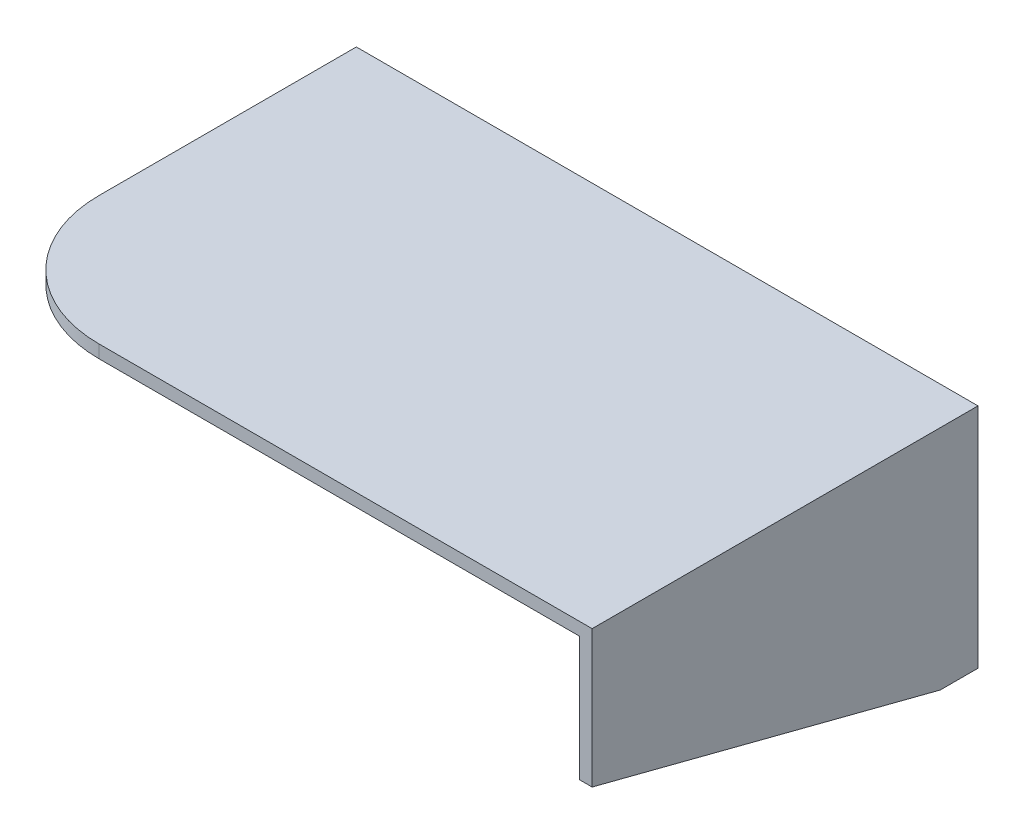
ISO-10303-21;
HEADER;
FILE_DESCRIPTION(('STEP AP214'),'2;1');
FILE_NAME('part.step','',(''),(''),'','','');
FILE_SCHEMA(('AUTOMOTIVE_DESIGN { 1 0 10303 214 1 1 1 1 }'));
ENDSEC;
DATA;
#1=APPLICATION_CONTEXT('core data for automotive mechanical design processes');
#2=APPLICATION_PROTOCOL_DEFINITION('international standard','automotive_design',2000,#1);
#3=PRODUCT_CONTEXT('',#1,'mechanical');
#4=PRODUCT('Part','Part','',(#3));
#5=PRODUCT_RELATED_PRODUCT_CATEGORY('part','',(#4));
#6=PRODUCT_DEFINITION_FORMATION('','',#4);
#7=PRODUCT_DEFINITION_CONTEXT('part definition',#1,'design');
#8=PRODUCT_DEFINITION('design','',#6,#7);
#9=PRODUCT_DEFINITION_SHAPE('','',#8);
#10=(LENGTH_UNIT() NAMED_UNIT(*) SI_UNIT(.MILLI.,.METRE.));
#11=(NAMED_UNIT(*) PLANE_ANGLE_UNIT() SI_UNIT($,.RADIAN.));
#12=(NAMED_UNIT(*) SI_UNIT($,.STERADIAN.) SOLID_ANGLE_UNIT());
#13=UNCERTAINTY_MEASURE_WITH_UNIT(LENGTH_MEASURE(1.E-05),#10,'distance_accuracy_value','');
#14=(GEOMETRIC_REPRESENTATION_CONTEXT(3) GLOBAL_UNCERTAINTY_ASSIGNED_CONTEXT((#13)) GLOBAL_UNIT_ASSIGNED_CONTEXT((#10,
#11,#12)) REPRESENTATION_CONTEXT('',''));
#15=CARTESIAN_POINT('',(0.,0.,0.));
#16=DIRECTION('',(0.,0.,1.));
#17=DIRECTION('',(1.,0.,0.));
#18=AXIS2_PLACEMENT_3D('',#15,#16,#17);
#19=CARTESIAN_POINT('',(-6.15241498392368,0.,6.));
#20=DIRECTION('',(-1.,0.,0.));
#21=DIRECTION('',(0.,-1.,0.));
#22=AXIS2_PLACEMENT_3D('',#19,#20,#21);
#23=PLANE('',#22);
#24=DIRECTION('',(0.,0.,-1.));
#25=VECTOR('',#24,1.);
#26=CARTESIAN_POINT('',(-6.15241498392364,1.,90.0000000000001));
#27=LINE('',#26,#25);
#28=CARTESIAN_POINT('',(-6.15241498392364,1.,6.00000000000001));
#29=VERTEX_POINT('',#28);
#30=CARTESIAN_POINT('',(-6.15241498392364,1.,0.));
#31=VERTEX_POINT('',#30);
#32=EDGE_CURVE('E541',#29,#31,#27,.T.);
#33=ORIENTED_EDGE('',*,*,#32,.F.);
#34=DIRECTION('',(0.,1.,0.));
#35=VECTOR('',#34,1.);
#36=CARTESIAN_POINT('',(-6.15241498392368,0.,6.));
#37=LINE('',#36,#35);
#38=CARTESIAN_POINT('',(-6.15241498392372,4.04799999999993,6.));
#39=VERTEX_POINT('',#38);
#40=EDGE_CURVE('E281',#29,#39,#37,.T.);
#41=ORIENTED_EDGE('',*,*,#40,.T.);
#42=DIRECTION('',(0.,0.,-1.));
#43=VECTOR('',#42,1.);
#44=CARTESIAN_POINT('',(-6.15241498392372,4.04799999999993,6.));
#45=LINE('',#44,#43);
#46=CARTESIAN_POINT('',(-6.15241498392372,4.04799999999993,0.));
#47=VERTEX_POINT('',#46);
#48=EDGE_CURVE('E360',#39,#47,#45,.T.);
#49=ORIENTED_EDGE('',*,*,#48,.T.);
#50=DIRECTION('',(0.,1.,0.));
#51=VECTOR('',#50,1.);
#52=CARTESIAN_POINT('',(-6.15241498392368,0.,0.));
#53=LINE('',#52,#51);
#54=EDGE_CURVE('E323',#31,#47,#53,.T.);
#55=ORIENTED_EDGE('',*,*,#54,.F.);
#56=EDGE_LOOP('',(#33,#41,#49,#55));
#57=FACE_BOUND('',#56,.T.);
#58=ADVANCED_FACE('F45',(#57),#23,.T.);
#59=CARTESIAN_POINT('',(0.,4.05,6.));
#60=DIRECTION('',(0.,1.,0.));
#61=DIRECTION('',(0.,0.,1.));
#62=AXIS2_PLACEMENT_3D('',#59,#60,#61);
#63=PLANE('',#62);
#64=DIRECTION('',(1.,0.,0.));
#65=VECTOR('',#64,1.);
#66=CARTESIAN_POINT('',(0.,4.05,0.));
#67=LINE('',#66,#65);
#68=CARTESIAN_POINT('',(0.,4.05,0.));
#69=VERTEX_POINT('',#68);
#70=CARTESIAN_POINT('',(2.49999999999992,4.05,0.));
#71=VERTEX_POINT('',#70);
#72=EDGE_CURVE('E262',#69,#71,#67,.T.);
#73=ORIENTED_EDGE('',*,*,#72,.F.);
#74=DIRECTION('',(0.,0.,-1.));
#75=VECTOR('',#74,1.);
#76=CARTESIAN_POINT('',(0.,4.05,6.));
#77=LINE('',#76,#75);
#78=CARTESIAN_POINT('',(0.,4.05,6.));
#79=VERTEX_POINT('',#78);
#80=EDGE_CURVE('E370',#79,#69,#77,.T.);
#81=ORIENTED_EDGE('',*,*,#80,.F.);
#82=DIRECTION('',(1.,0.,0.));
#83=VECTOR('',#82,1.);
#84=CARTESIAN_POINT('',(0.,4.05,6.));
#85=LINE('',#84,#83);
#86=CARTESIAN_POINT('',(2.49999999999992,4.05,6.));
#87=VERTEX_POINT('',#86);
#88=EDGE_CURVE('E263',#79,#87,#85,.T.);
#89=ORIENTED_EDGE('',*,*,#88,.T.);
#90=DIRECTION('',(0.,0.,-1.));
#91=VECTOR('',#90,1.);
#92=CARTESIAN_POINT('',(2.49999999999992,4.05,6.));
#93=LINE('',#92,#91);
#94=EDGE_CURVE('E306',#87,#71,#93,.T.);
#95=ORIENTED_EDGE('',*,*,#94,.T.);
#96=EDGE_LOOP('',(#73,#81,#89,#95));
#97=FACE_BOUND('',#96,.T.);
#98=ADVANCED_FACE('F584',(#97),#63,.T.);
#99=CARTESIAN_POINT('',(0.,0.,6.));
#100=DIRECTION('',(1.,0.,0.));
#101=DIRECTION('',(0.,1.,0.));
#102=AXIS2_PLACEMENT_3D('',#99,#100,#101);
#103=PLANE('',#102);
#104=DIRECTION('',(0.,-1.,0.));
#105=VECTOR('',#104,1.);
#106=CARTESIAN_POINT('',(0.,0.,0.));
#107=LINE('',#106,#105);
#108=CARTESIAN_POINT('',(0.,7.95,0.));
#109=VERTEX_POINT('',#108);
#110=EDGE_CURVE('E310',#109,#69,#107,.T.);
#111=ORIENTED_EDGE('',*,*,#110,.F.);
#112=DIRECTION('',(0.,0.,-1.));
#113=VECTOR('',#112,1.);
#114=CARTESIAN_POINT('',(0.,7.95,6.));
#115=LINE('',#114,#113);
#116=CARTESIAN_POINT('',(0.,7.95,6.));
#117=VERTEX_POINT('',#116);
#118=EDGE_CURVE('E367',#117,#109,#115,.T.);
#119=ORIENTED_EDGE('',*,*,#118,.F.);
#120=DIRECTION('',(0.,-1.,0.));
#121=VECTOR('',#120,1.);
#122=CARTESIAN_POINT('',(0.,0.,6.));
#123=LINE('',#122,#121);
#124=EDGE_CURVE('E267',#117,#79,#123,.T.);
#125=ORIENTED_EDGE('',*,*,#124,.T.);
#126=ORIENTED_EDGE('',*,*,#80,.T.);
#127=EDGE_LOOP('',(#111,#119,#125,#126));
#128=FACE_BOUND('',#127,.T.);
#129=ADVANCED_FACE('F582',(#128),#103,.T.);
#130=CARTESIAN_POINT('',(0.,7.95,6.));
#131=DIRECTION('',(0.,1.,0.));
#132=DIRECTION('',(-1.,0.,0.));
#133=AXIS2_PLACEMENT_3D('',#130,#131,#132);
#134=PLANE('',#133);
#135=DIRECTION('',(1.,0.,0.));
#136=VECTOR('',#135,1.);
#137=CARTESIAN_POINT('',(0.,7.95,0.));
#138=LINE('',#137,#136);
#139=CARTESIAN_POINT('',(-2.04000000000008,7.94999999999998,0.));
#140=VERTEX_POINT('',#139);
#141=EDGE_CURVE('E314',#140,#109,#138,.T.);
#142=ORIENTED_EDGE('',*,*,#141,.F.);
#143=DIRECTION('',(0.,0.,-1.));
#144=VECTOR('',#143,1.);
#145=CARTESIAN_POINT('',(-2.04000000000008,7.94999999999998,6.));
#146=LINE('',#145,#144);
#147=CARTESIAN_POINT('',(-2.04000000000008,7.94999999999998,6.));
#148=VERTEX_POINT('',#147);
#149=EDGE_CURVE('E364',#148,#140,#146,.T.);
#150=ORIENTED_EDGE('',*,*,#149,.F.);
#151=DIRECTION('',(1.,0.,0.));
#152=VECTOR('',#151,1.);
#153=CARTESIAN_POINT('',(0.,7.95,6.));
#154=LINE('',#153,#152);
#155=EDGE_CURVE('E272',#148,#117,#154,.T.);
#156=ORIENTED_EDGE('',*,*,#155,.T.);
#157=ORIENTED_EDGE('',*,*,#118,.T.);
#158=EDGE_LOOP('',(#142,#150,#156,#157));
#159=FACE_BOUND('',#158,.T.);
#160=ADVANCED_FACE('F578',(#159),#134,.T.);
#161=CARTESIAN_POINT('',(-4.93600140143802,5.20217481392659,6.));
#162=DIRECTION('',(-0.688304815664146,0.725421588273706,0.));
#163=DIRECTION('',(-0.725421588273706,-0.688304815664146,0.));
#164=AXIS2_PLACEMENT_3D('',#161,#162,#163);
#165=PLANE('',#164);
#166=DIRECTION('',(0.725421588273706,0.688304815664146,0.));
#167=VECTOR('',#166,1.);
#168=CARTESIAN_POINT('',(-4.93600140143802,5.20217481392659,0.));
#169=LINE('',#168,#167);
#170=EDGE_CURVE('E319',#47,#140,#169,.T.);
#171=ORIENTED_EDGE('',*,*,#170,.F.);
#172=ORIENTED_EDGE('',*,*,#48,.F.);
#173=DIRECTION('',(0.725421588273706,0.688304815664146,0.));
#174=VECTOR('',#173,1.);
#175=CARTESIAN_POINT('',(-4.93600140143802,5.20217481392659,6.));
#176=LINE('',#175,#174);
#177=EDGE_CURVE('E277',#39,#148,#176,.T.);
#178=ORIENTED_EDGE('',*,*,#177,.T.);
#179=ORIENTED_EDGE('',*,*,#149,.T.);
#180=EDGE_LOOP('',(#171,#172,#178,#179));
#181=FACE_BOUND('',#180,.T.);
#182=ADVANCED_FACE('F575',(#181),#165,.T.);
#183=DIRECTION('',(0.,0.,-1.));
#184=VECTOR('',#183,1.);
#185=CARTESIAN_POINT('',(-6.15241498392364,-1.,90.0000000000001));
#186=LINE('',#185,#184);
#187=CARTESIAN_POINT('',(-6.15241498392364,-1.,6.00000000000001));
#188=VERTEX_POINT('',#187);
#189=CARTESIAN_POINT('',(-6.15241498392364,-1.,0.));
#190=VERTEX_POINT('',#189);
#191=EDGE_CURVE('E544',#188,#190,#186,.T.);
#192=ORIENTED_EDGE('',*,*,#191,.T.);
#193=CARTESIAN_POINT('',(-6.15241498392364,-4.04800000000007,0.));
#194=VERTEX_POINT('',#193);
#195=EDGE_CURVE('E324',#194,#190,#53,.T.);
#196=ORIENTED_EDGE('',*,*,#195,.F.);
#197=DIRECTION('',(0.,0.,-1.));
#198=VECTOR('',#197,1.);
#199=CARTESIAN_POINT('',(-6.15241498392364,-4.04800000000007,6.));
#200=LINE('',#199,#198);
#201=CARTESIAN_POINT('',(-6.15241498392364,-4.04800000000007,6.));
#202=VERTEX_POINT('',#201);
#203=EDGE_CURVE('E357',#202,#194,#200,.T.);
#204=ORIENTED_EDGE('',*,*,#203,.F.);
#205=EDGE_CURVE('E282',#202,#188,#37,.T.);
#206=ORIENTED_EDGE('',*,*,#205,.T.);
#207=EDGE_LOOP('',(#192,#196,#204,#206));
#208=FACE_BOUND('',#207,.T.);
#209=ADVANCED_FACE('F594',(#208),#23,.T.);
#210=CARTESIAN_POINT('',(-4.93600140143791,-5.2021748139267,6.));
#211=DIRECTION('',(-0.68830481566413,-0.725421588273721,0.));
#212=DIRECTION('',(0.725421588273721,-0.68830481566413,0.));
#213=AXIS2_PLACEMENT_3D('',#210,#211,#212);
#214=PLANE('',#213);
#215=DIRECTION('',(-0.725421588273721,0.68830481566413,0.));
#216=VECTOR('',#215,1.);
#217=CARTESIAN_POINT('',(-4.93600140143791,-5.2021748139267,0.));
#218=LINE('',#217,#216);
#219=CARTESIAN_POINT('',(-2.03999999999991,-7.95000000000002,0.));
#220=VERTEX_POINT('',#219);
#221=EDGE_CURVE('E328',#220,#194,#218,.T.);
#222=ORIENTED_EDGE('',*,*,#221,.F.);
#223=DIRECTION('',(0.,0.,-1.));
#224=VECTOR('',#223,1.);
#225=CARTESIAN_POINT('',(-2.03999999999991,-7.95000000000002,6.));
#226=LINE('',#225,#224);
#227=CARTESIAN_POINT('',(-2.03999999999991,-7.95000000000002,6.));
#228=VERTEX_POINT('',#227);
#229=EDGE_CURVE('E354',#228,#220,#226,.T.);
#230=ORIENTED_EDGE('',*,*,#229,.F.);
#231=DIRECTION('',(-0.725421588273721,0.68830481566413,0.));
#232=VECTOR('',#231,1.);
#233=CARTESIAN_POINT('',(-4.93600140143791,-5.2021748139267,6.));
#234=LINE('',#233,#232);
#235=EDGE_CURVE('E286',#228,#202,#234,.T.);
#236=ORIENTED_EDGE('',*,*,#235,.T.);
#237=ORIENTED_EDGE('',*,*,#203,.T.);
#238=EDGE_LOOP('',(#222,#230,#236,#237));
#239=FACE_BOUND('',#238,.T.);
#240=ADVANCED_FACE('F647',(#239),#214,.T.);
#241=CARTESIAN_POINT('',(0.,-7.95,6.));
#242=DIRECTION('',(0.,-1.,0.));
#243=DIRECTION('',(1.,0.,0.));
#244=AXIS2_PLACEMENT_3D('',#241,#242,#243);
#245=PLANE('',#244);
#246=DIRECTION('',(-1.,0.,0.));
#247=VECTOR('',#246,1.);
#248=CARTESIAN_POINT('',(0.,-7.95,0.));
#249=LINE('',#248,#247);
#250=CARTESIAN_POINT('',(0.,-7.95,0.));
#251=VERTEX_POINT('',#250);
#252=EDGE_CURVE('E332',#251,#220,#249,.T.);
#253=ORIENTED_EDGE('',*,*,#252,.F.);
#254=DIRECTION('',(0.,0.,-1.));
#255=VECTOR('',#254,1.);
#256=CARTESIAN_POINT('',(0.,-7.95,6.));
#257=LINE('',#256,#255);
#258=CARTESIAN_POINT('',(0.,-7.95,6.));
#259=VERTEX_POINT('',#258);
#260=EDGE_CURVE('E351',#259,#251,#257,.T.);
#261=ORIENTED_EDGE('',*,*,#260,.F.);
#262=DIRECTION('',(-1.,0.,0.));
#263=VECTOR('',#262,1.);
#264=CARTESIAN_POINT('',(0.,-7.95,6.));
#265=LINE('',#264,#263);
#266=EDGE_CURVE('E290',#259,#228,#265,.T.);
#267=ORIENTED_EDGE('',*,*,#266,.T.);
#268=ORIENTED_EDGE('',*,*,#229,.T.);
#269=EDGE_LOOP('',(#253,#261,#267,#268));
#270=FACE_BOUND('',#269,.T.);
#271=ADVANCED_FACE('F643',(#270),#245,.T.);
#272=CARTESIAN_POINT('',(0.,-4.05,0.));
#273=VERTEX_POINT('',#272);
#274=EDGE_CURVE('E315',#273,#251,#107,.T.);
#275=ORIENTED_EDGE('',*,*,#274,.F.);
#276=DIRECTION('',(0.,0.,-1.));
#277=VECTOR('',#276,1.);
#278=CARTESIAN_POINT('',(0.,-4.05,6.));
#279=LINE('',#278,#277);
#280=CARTESIAN_POINT('',(0.,-4.05,6.));
#281=VERTEX_POINT('',#280);
#282=EDGE_CURVE('E348',#281,#273,#279,.T.);
#283=ORIENTED_EDGE('',*,*,#282,.F.);
#284=EDGE_CURVE('E273',#281,#259,#123,.T.);
#285=ORIENTED_EDGE('',*,*,#284,.T.);
#286=ORIENTED_EDGE('',*,*,#260,.T.);
#287=EDGE_LOOP('',(#275,#283,#285,#286));
#288=FACE_BOUND('',#287,.T.);
#289=ADVANCED_FACE('F592',(#288),#103,.T.);
#290=CARTESIAN_POINT('',(0.,-4.05,6.));
#291=DIRECTION('',(0.,1.,0.));
#292=DIRECTION('',(-1.,0.,0.));
#293=AXIS2_PLACEMENT_3D('',#290,#291,#292);
#294=PLANE('',#293);
#295=CARTESIAN_POINT('',(13.4999999999999,-4.05,6.));
#296=DIRECTION('',(0.,1.,0.));
#297=DIRECTION('',(-1.,0.,0.));
#298=AXIS2_PLACEMENT_3D('',#295,#296,#297);
#299=CIRCLE('',#298,3.);
#300=CARTESIAN_POINT('',(13.4999999999999,-4.05,3.));
#301=VERTEX_POINT('',#300);
#302=CARTESIAN_POINT('',(10.9019237886466,-4.05,4.5));
#303=VERTEX_POINT('',#302);
#304=EDGE_CURVE('E383',#301,#303,#299,.T.);
#305=ORIENTED_EDGE('',*,*,#304,.T.);
#306=CARTESIAN_POINT('',(8.30384757729329,-4.05,3.));
#307=DIRECTION('',(0.,1.,0.));
#308=DIRECTION('',(-1.,0.,0.));
#309=AXIS2_PLACEMENT_3D('',#306,#307,#308);
#310=CIRCLE('',#309,3.);
#311=CARTESIAN_POINT('',(8.3038475772933,-4.05,6.));
#312=VERTEX_POINT('',#311);
#313=EDGE_CURVE('E391',#303,#312,#310,.F.);
#314=ORIENTED_EDGE('',*,*,#313,.T.);
#315=DIRECTION('',(1.,0.,0.));
#316=VECTOR('',#315,1.);
#317=CARTESIAN_POINT('',(0.,-4.05,6.));
#318=LINE('',#317,#316);
#319=EDGE_CURVE('E294',#281,#312,#318,.T.);
#320=ORIENTED_EDGE('',*,*,#319,.F.);
#321=ORIENTED_EDGE('',*,*,#282,.T.);
#322=DIRECTION('',(1.,0.,0.));
#323=VECTOR('',#322,1.);
#324=CARTESIAN_POINT('',(0.,-4.05,0.));
#325=LINE('',#324,#323);
#326=CARTESIAN_POINT('',(10.4999999999999,-4.05,0.));
#327=VERTEX_POINT('',#326);
#328=EDGE_CURVE('E336',#273,#327,#325,.T.);
#329=ORIENTED_EDGE('',*,*,#328,.T.);
#330=DIRECTION('',(0.,0.,-1.));
#331=VECTOR('',#330,1.);
#332=CARTESIAN_POINT('',(10.4999999999999,-4.05,6.));
#333=LINE('',#332,#331);
#334=CARTESIAN_POINT('',(10.4999999999999,-4.05,3.));
#335=VERTEX_POINT('',#334);
#336=EDGE_CURVE('E447',#335,#327,#333,.T.);
#337=ORIENTED_EDGE('',*,*,#336,.F.);
#338=DIRECTION('',(-1.,0.,0.));
#339=VECTOR('',#338,1.);
#340=CARTESIAN_POINT('',(0.,-4.05,3.));
#341=LINE('',#340,#339);
#342=EDGE_CURVE('E373',#301,#335,#341,.T.);
#343=ORIENTED_EDGE('',*,*,#342,.F.);
#344=EDGE_LOOP('',(#305,#314,#320,#321,#329,#337,#343));
#345=FACE_BOUND('',#344,.T.);
#346=ADVANCED_FACE('F482',(#345),#294,.F.);
#347=CARTESIAN_POINT('',(2.49999999999992,0.,6.));
#348=DIRECTION('',(-1.,0.,0.));
#349=DIRECTION('',(0.,0.,1.));
#350=AXIS2_PLACEMENT_3D('',#347,#348,#349);
#351=PLANE('',#350);
#352=DIRECTION('',(0.,1.,0.));
#353=VECTOR('',#352,1.);
#354=CARTESIAN_POINT('',(2.49999999999992,0.,0.));
#355=LINE('',#354,#353);
#356=CARTESIAN_POINT('',(2.49999999999992,30.95,0.));
#357=VERTEX_POINT('',#356);
#358=EDGE_CURVE('E268',#71,#357,#355,.T.);
#359=ORIENTED_EDGE('',*,*,#358,.F.);
#360=ORIENTED_EDGE('',*,*,#94,.F.);
#361=DIRECTION('',(0.,1.,0.));
#362=VECTOR('',#361,1.);
#363=CARTESIAN_POINT('',(2.49999999999992,0.,6.));
#364=LINE('',#363,#362);
#365=CARTESIAN_POINT('',(2.49999999999992,30.95,6.));
#366=VERTEX_POINT('',#365);
#367=EDGE_CURVE('E302',#87,#366,#364,.T.);
#368=ORIENTED_EDGE('',*,*,#367,.T.);
#369=DIRECTION('',(0.,0.,-1.));
#370=VECTOR('',#369,1.);
#371=CARTESIAN_POINT('',(2.49999999999992,30.95,6.));
#372=LINE('',#371,#370);
#373=EDGE_CURVE('E344',#366,#357,#372,.T.);
#374=ORIENTED_EDGE('',*,*,#373,.T.);
#375=EDGE_LOOP('',(#359,#360,#368,#374));
#376=FACE_BOUND('',#375,.T.);
#377=ADVANCED_FACE('F464',(#376),#351,.T.);
#378=CARTESIAN_POINT('',(0.,0.,6.));
#379=DIRECTION('',(0.,0.,1.));
#380=DIRECTION('',(1.,0.,0.));
#381=AXIS2_PLACEMENT_3D('',#378,#379,#380);
#382=PLANE('',#381);
#383=DIRECTION('',(-1.,0.,0.));
#384=VECTOR('',#383,1.);
#385=CARTESIAN_POINT('',(0.,1.,6.));
#386=LINE('',#385,#384);
#387=CARTESIAN_POINT('',(-2.15241498392364,1.,6.00000000000001));
#388=VERTEX_POINT('',#387);
#389=EDGE_CURVE('E552',#388,#29,#386,.T.);
#390=ORIENTED_EDGE('',*,*,#389,.F.);
#391=DIRECTION('',(0.,1.,0.));
#392=VECTOR('',#391,1.);
#393=CARTESIAN_POINT('',(-2.15241498392364,0.,6.));
#394=LINE('',#393,#392);
#395=CARTESIAN_POINT('',(-2.15241498392364,-1.,6.00000000000001));
#396=VERTEX_POINT('',#395);
#397=EDGE_CURVE('E511',#396,#388,#394,.T.);
#398=ORIENTED_EDGE('',*,*,#397,.F.);
#399=DIRECTION('',(1.,0.,0.));
#400=VECTOR('',#399,1.);
#401=CARTESIAN_POINT('',(0.,-1.,6.));
#402=LINE('',#401,#400);
#403=EDGE_CURVE('E540',#188,#396,#402,.T.);
#404=ORIENTED_EDGE('',*,*,#403,.F.);
#405=ORIENTED_EDGE('',*,*,#205,.F.);
#406=ORIENTED_EDGE('',*,*,#235,.F.);
#407=ORIENTED_EDGE('',*,*,#266,.F.);
#408=ORIENTED_EDGE('',*,*,#284,.F.);
#409=ORIENTED_EDGE('',*,*,#319,.T.);
#410=DIRECTION('',(0.,-1.,0.));
#411=VECTOR('',#410,1.);
#412=CARTESIAN_POINT('',(8.30384757729329,30.95,6.));
#413=LINE('',#412,#411);
#414=CARTESIAN_POINT('',(8.30384757729329,30.95,6.));
#415=VERTEX_POINT('',#414);
#416=EDGE_CURVE('E394',#312,#415,#413,.F.);
#417=ORIENTED_EDGE('',*,*,#416,.T.);
#418=DIRECTION('',(1.,0.,0.));
#419=VECTOR('',#418,1.);
#420=CARTESIAN_POINT('',(0.,30.95,6.));
#421=LINE('',#420,#419);
#422=EDGE_CURVE('E298',#366,#415,#421,.T.);
#423=ORIENTED_EDGE('',*,*,#422,.F.);
#424=ORIENTED_EDGE('',*,*,#367,.F.);
#425=ORIENTED_EDGE('',*,*,#88,.F.);
#426=ORIENTED_EDGE('',*,*,#124,.F.);
#427=ORIENTED_EDGE('',*,*,#155,.F.);
#428=ORIENTED_EDGE('',*,*,#177,.F.);
#429=ORIENTED_EDGE('',*,*,#40,.F.);
#430=EDGE_LOOP('',(#390,#398,#404,#405,#406,#407,#408,#409,#417,#423,#424,#425,#426,#427,#428,#429));
#431=FACE_BOUND('',#430,.T.);
#432=ADVANCED_FACE('F469',(#431),#382,.T.);
#433=CARTESIAN_POINT('',(0.,0.,0.));
#434=DIRECTION('',(0.,0.,1.));
#435=DIRECTION('',(1.,0.,0.));
#436=AXIS2_PLACEMENT_3D('',#433,#434,#435);
#437=PLANE('',#436);
#438=DIRECTION('',(0.,-1.,0.));
#439=VECTOR('',#438,1.);
#440=CARTESIAN_POINT('',(-2.15241498392364,-1.,0.));
#441=LINE('',#440,#439);
#442=CARTESIAN_POINT('',(-2.15241498392364,1.,0.));
#443=VERTEX_POINT('',#442);
#444=CARTESIAN_POINT('',(-2.15241498392364,-1.,0.));
#445=VERTEX_POINT('',#444);
#446=EDGE_CURVE('E68',#443,#445,#441,.T.);
#447=ORIENTED_EDGE('',*,*,#446,.F.);
#448=DIRECTION('',(1.,0.,0.));
#449=VECTOR('',#448,1.);
#450=CARTESIAN_POINT('',(-2.15241498392364,1.,0.));
#451=LINE('',#450,#449);
#452=EDGE_CURVE('E532',#31,#443,#451,.T.);
#453=ORIENTED_EDGE('',*,*,#452,.F.);
#454=ORIENTED_EDGE('',*,*,#54,.T.);
#455=ORIENTED_EDGE('',*,*,#170,.T.);
#456=ORIENTED_EDGE('',*,*,#141,.T.);
#457=ORIENTED_EDGE('',*,*,#110,.T.);
#458=ORIENTED_EDGE('',*,*,#72,.T.);
#459=ORIENTED_EDGE('',*,*,#358,.T.);
#460=DIRECTION('',(-1.,0.,0.));
#461=VECTOR('',#460,1.);
#462=CARTESIAN_POINT('',(0.,30.95,0.));
#463=LINE('',#462,#461);
#464=CARTESIAN_POINT('',(-49.5000000000001,30.95,0.));
#465=VERTEX_POINT('',#464);
#466=EDGE_CURVE('E444',#357,#465,#463,.T.);
#467=ORIENTED_EDGE('',*,*,#466,.T.);
#468=DIRECTION('',(0.,1.,0.));
#469=VECTOR('',#468,1.);
#470=CARTESIAN_POINT('',(-49.5000000000001,0.,0.));
#471=LINE('',#470,#469);
#472=CARTESIAN_POINT('',(-49.5000000000001,33.95,0.));
#473=VERTEX_POINT('',#472);
#474=EDGE_CURVE('E427',#465,#473,#471,.T.);
#475=ORIENTED_EDGE('',*,*,#474,.T.);
#476=DIRECTION('',(1.,0.,0.));
#477=VECTOR('',#476,1.);
#478=CARTESIAN_POINT('',(0.,33.95,0.));
#479=LINE('',#478,#477);
#480=CARTESIAN_POINT('',(95.4999999999999,33.95,0.));
#481=VERTEX_POINT('',#480);
#482=EDGE_CURVE('E453',#473,#481,#479,.T.);
#483=ORIENTED_EDGE('',*,*,#482,.T.);
#484=DIRECTION('',(0.,-1.,0.));
#485=VECTOR('',#484,1.);
#486=CARTESIAN_POINT('',(95.4999999999999,0.,0.));
#487=LINE('',#486,#485);
#488=CARTESIAN_POINT('',(95.4999999999999,-19.05,0.));
#489=VERTEX_POINT('',#488);
#490=EDGE_CURVE('E450',#481,#489,#487,.T.);
#491=ORIENTED_EDGE('',*,*,#490,.T.);
#492=DIRECTION('',(-1.,0.,0.));
#493=VECTOR('',#492,1.);
#494=CARTESIAN_POINT('',(0.,-19.05,0.));
#495=LINE('',#494,#493);
#496=CARTESIAN_POINT('',(10.4999999999999,-19.05,0.));
#497=VERTEX_POINT('',#496);
#498=EDGE_CURVE('E245',#489,#497,#495,.T.);
#499=ORIENTED_EDGE('',*,*,#498,.T.);
#500=DIRECTION('',(0.,-1.,0.));
#501=VECTOR('',#500,1.);
#502=CARTESIAN_POINT('',(10.4999999999999,0.,0.));
#503=LINE('',#502,#501);
#504=EDGE_CURVE('E504',#327,#497,#503,.T.);
#505=ORIENTED_EDGE('',*,*,#504,.F.);
#506=ORIENTED_EDGE('',*,*,#328,.F.);
#507=ORIENTED_EDGE('',*,*,#274,.T.);
#508=ORIENTED_EDGE('',*,*,#252,.T.);
#509=ORIENTED_EDGE('',*,*,#221,.T.);
#510=ORIENTED_EDGE('',*,*,#195,.T.);
#511=DIRECTION('',(-1.,0.,0.));
#512=VECTOR('',#511,1.);
#513=CARTESIAN_POINT('',(-6.15241498392364,-1.,0.));
#514=LINE('',#513,#512);
#515=EDGE_CURVE('E527',#445,#190,#514,.T.);
#516=ORIENTED_EDGE('',*,*,#515,.F.);
#517=EDGE_LOOP('',(#447,#453,#454,#455,#456,#457,#458,#459,#467,#475,#483,#491,#499,#505,#506,
#507,#508,#509,#510,#516));
#518=FACE_BOUND('',#517,.T.);
#519=ADVANCED_FACE('F460',(#518),#437,.F.);
#520=CARTESIAN_POINT('',(0.,30.95,90.0000000000001));
#521=DIRECTION('',(0.,-1.,0.));
#522=DIRECTION('',(1.,0.,0.));
#523=AXIS2_PLACEMENT_3D('',#520,#521,#522);
#524=PLANE('',#523);
#525=DIRECTION('',(-1.,0.,0.));
#526=VECTOR('',#525,1.);
#527=CARTESIAN_POINT('',(0.,30.95,90.0000000000001));
#528=LINE('',#527,#526);
#529=CARTESIAN_POINT('',(92.4999999999999,30.95,90.0000000000001));
#530=VERTEX_POINT('',#529);
#531=CARTESIAN_POINT('',(-19.5000000000001,30.95,90.0000000000001));
#532=VERTEX_POINT('',#531);
#533=EDGE_CURVE('E418',#530,#532,#528,.T.);
#534=ORIENTED_EDGE('',*,*,#533,.T.);
#535=CARTESIAN_POINT('',(-19.5000000000001,30.95,60.0000000000001));
#536=DIRECTION('',(0.,-1.,0.));
#537=DIRECTION('',(1.,0.,0.));
#538=AXIS2_PLACEMENT_3D('',#535,#536,#537);
#539=CIRCLE('',#538,30.);
#540=CARTESIAN_POINT('',(-49.5000000000001,30.95,60.0000000000001));
#541=VERTEX_POINT('',#540);
#542=EDGE_CURVE('E54',#532,#541,#539,.T.);
#543=ORIENTED_EDGE('',*,*,#542,.T.);
#544=DIRECTION('',(0.,0.,-1.));
#545=VECTOR('',#544,1.);
#546=CARTESIAN_POINT('',(-49.5000000000001,30.95,90.0000000000001));
#547=LINE('',#546,#545);
#548=EDGE_CURVE('E415',#541,#465,#547,.T.);
#549=ORIENTED_EDGE('',*,*,#548,.T.);
#550=ORIENTED_EDGE('',*,*,#466,.F.);
#551=ORIENTED_EDGE('',*,*,#373,.F.);
#552=ORIENTED_EDGE('',*,*,#422,.T.);
#553=CARTESIAN_POINT('',(8.30384757729329,30.95,3.));
#554=DIRECTION('',(0.,-1.,0.));
#555=DIRECTION('',(1.,0.,0.));
#556=AXIS2_PLACEMENT_3D('',#553,#554,#555);
#557=CIRCLE('',#556,3.);
#558=CARTESIAN_POINT('',(10.9019237886466,30.95,4.5));
#559=VERTEX_POINT('',#558);
#560=EDGE_CURVE('E397',#415,#559,#557,.F.);
#561=ORIENTED_EDGE('',*,*,#560,.T.);
#562=CARTESIAN_POINT('',(13.4999999999999,30.95,6.));
#563=DIRECTION('',(0.,-1.,0.));
#564=DIRECTION('',(1.,0.,0.));
#565=AXIS2_PLACEMENT_3D('',#562,#563,#564);
#566=CIRCLE('',#565,3.);
#567=CARTESIAN_POINT('',(13.4999999999999,30.95,3.));
#568=VERTEX_POINT('',#567);
#569=EDGE_CURVE('E380',#559,#568,#566,.T.);
#570=ORIENTED_EDGE('',*,*,#569,.T.);
#571=DIRECTION('',(1.,0.,0.));
#572=VECTOR('',#571,1.);
#573=CARTESIAN_POINT('',(0.,30.95,3.));
#574=LINE('',#573,#572);
#575=CARTESIAN_POINT('',(92.4999999999999,30.95,3.));
#576=VERTEX_POINT('',#575);
#577=EDGE_CURVE('E491',#568,#576,#574,.T.);
#578=ORIENTED_EDGE('',*,*,#577,.T.);
#579=DIRECTION('',(0.,0.,-1.));
#580=VECTOR('',#579,1.);
#581=CARTESIAN_POINT('',(92.4999999999999,30.95,90.0000000000001));
#582=LINE('',#581,#580);
#583=EDGE_CURVE('E253',#530,#576,#582,.T.);
#584=ORIENTED_EDGE('',*,*,#583,.F.);
#585=EDGE_LOOP('',(#534,#543,#549,#550,#551,#552,#561,#570,#578,#584));
#586=FACE_BOUND('',#585,.T.);
#587=ADVANCED_FACE('F414',(#586),#524,.T.);
#588=CARTESIAN_POINT('',(92.4999999999999,0.,90.0000000000001));
#589=DIRECTION('',(1.,0.,0.));
#590=DIRECTION('',(0.,0.,-1.));
#591=AXIS2_PLACEMENT_3D('',#588,#589,#590);
#592=PLANE('',#591);
#593=DIRECTION('',(0.,0.,-1.));
#594=VECTOR('',#593,1.);
#595=CARTESIAN_POINT('',(92.4999999999999,-19.05,90.0000000000001));
#596=LINE('',#595,#594);
#597=CARTESIAN_POINT('',(92.4999999999999,-19.05,8.79902500712436));
#598=VERTEX_POINT('',#597);
#599=CARTESIAN_POINT('',(92.4999999999999,-19.05,3.));
#600=VERTEX_POINT('',#599);
#601=EDGE_CURVE('E248',#598,#600,#596,.T.);
#602=ORIENTED_EDGE('',*,*,#601,.F.);
#603=DIRECTION('',(0.,0.250380004054435,0.968147640378109));
#604=VECTOR('',#603,1.);
#605=CARTESIAN_POINT('',(92.4999999999999,1.82775421446091,89.5273106202599));
#606=LINE('',#605,#604);
#607=CARTESIAN_POINT('',(92.4999999999999,1.94999999999999,90.0000000000001));
#608=VERTEX_POINT('',#607);
#609=EDGE_CURVE('E226',#598,#608,#606,.T.);
#610=ORIENTED_EDGE('',*,*,#609,.T.);
#611=DIRECTION('',(0.,-1.,0.));
#612=VECTOR('',#611,1.);
#613=CARTESIAN_POINT('',(92.4999999999999,0.,90.0000000000001));
#614=LINE('',#613,#612);
#615=EDGE_CURVE('E440',#530,#608,#614,.T.);
#616=ORIENTED_EDGE('',*,*,#615,.F.);
#617=ORIENTED_EDGE('',*,*,#583,.T.);
#618=DIRECTION('',(0.,-1.,0.));
#619=VECTOR('',#618,1.);
#620=CARTESIAN_POINT('',(92.4999999999999,0.,3.));
#621=LINE('',#620,#619);
#622=EDGE_CURVE('E494',#576,#600,#621,.T.);
#623=ORIENTED_EDGE('',*,*,#622,.T.);
#624=EDGE_LOOP('',(#602,#610,#616,#617,#623));
#625=FACE_BOUND('',#624,.T.);
#626=ADVANCED_FACE('F523',(#625),#592,.F.);
#627=CARTESIAN_POINT('',(0.,-19.05,90.0000000000001));
#628=DIRECTION('',(0.,-1.,0.));
#629=DIRECTION('',(1.,0.,0.));
#630=AXIS2_PLACEMENT_3D('',#627,#628,#629);
#631=PLANE('',#630);
#632=DIRECTION('',(1.,0.,0.));
#633=VECTOR('',#632,1.);
#634=CARTESIAN_POINT('',(-49.5000000000001,-19.05,8.79902500712436));
#635=LINE('',#634,#633);
#636=CARTESIAN_POINT('',(95.4999999999999,-19.05,8.79902500712436));
#637=VERTEX_POINT('',#636);
#638=EDGE_CURVE('E223',#598,#637,#635,.T.);
#639=ORIENTED_EDGE('',*,*,#638,.F.);
#640=ORIENTED_EDGE('',*,*,#601,.T.);
#641=DIRECTION('',(-1.,0.,0.));
#642=VECTOR('',#641,1.);
#643=CARTESIAN_POINT('',(0.,-19.05,3.));
#644=LINE('',#643,#642);
#645=CARTESIAN_POINT('',(10.4999999999999,-19.05,3.));
#646=VERTEX_POINT('',#645);
#647=EDGE_CURVE('E497',#600,#646,#644,.T.);
#648=ORIENTED_EDGE('',*,*,#647,.T.);
#649=DIRECTION('',(0.,0.,-1.));
#650=VECTOR('',#649,1.);
#651=CARTESIAN_POINT('',(10.4999999999999,-19.05,3.));
#652=LINE('',#651,#650);
#653=EDGE_CURVE('E501',#646,#497,#652,.T.);
#654=ORIENTED_EDGE('',*,*,#653,.T.);
#655=ORIENTED_EDGE('',*,*,#498,.F.);
#656=DIRECTION('',(0.,0.,-1.));
#657=VECTOR('',#656,1.);
#658=CARTESIAN_POINT('',(95.4999999999999,-19.05,90.0000000000001));
#659=LINE('',#658,#657);
#660=EDGE_CURVE('E236',#637,#489,#659,.T.);
#661=ORIENTED_EDGE('',*,*,#660,.F.);
#662=EDGE_LOOP('',(#639,#640,#648,#654,#655,#661));
#663=FACE_BOUND('',#662,.T.);
#664=ADVANCED_FACE('F243',(#663),#631,.T.);
#665=CARTESIAN_POINT('',(95.4999999999999,0.,90.0000000000001));
#666=DIRECTION('',(1.,0.,0.));
#667=DIRECTION('',(0.,1.,0.));
#668=AXIS2_PLACEMENT_3D('',#665,#666,#667);
#669=PLANE('',#668);
#670=DIRECTION('',(0.,0.250380004054435,0.968147640378109));
#671=VECTOR('',#670,1.);
#672=CARTESIAN_POINT('',(95.4999999999999,-19.05,8.79902500712436));
#673=LINE('',#672,#671);
#674=CARTESIAN_POINT('',(95.4999999999999,1.94999999999999,90.0000000000001));
#675=VERTEX_POINT('',#674);
#676=EDGE_CURVE('E60',#637,#675,#673,.T.);
#677=ORIENTED_EDGE('',*,*,#676,.F.);
#678=ORIENTED_EDGE('',*,*,#660,.T.);
#679=ORIENTED_EDGE('',*,*,#490,.F.);
#680=DIRECTION('',(0.,0.,-1.));
#681=VECTOR('',#680,1.);
#682=CARTESIAN_POINT('',(95.4999999999999,33.95,90.0000000000001));
#683=LINE('',#682,#681);
#684=CARTESIAN_POINT('',(95.4999999999999,33.95,90.0000000000001));
#685=VERTEX_POINT('',#684);
#686=EDGE_CURVE('E249',#685,#481,#683,.T.);
#687=ORIENTED_EDGE('',*,*,#686,.F.);
#688=DIRECTION('',(0.,-1.,0.));
#689=VECTOR('',#688,1.);
#690=CARTESIAN_POINT('',(95.4999999999999,0.,90.0000000000001));
#691=LINE('',#690,#689);
#692=EDGE_CURVE('E240',#685,#675,#691,.T.);
#693=ORIENTED_EDGE('',*,*,#692,.T.);
#694=EDGE_LOOP('',(#677,#678,#679,#687,#693));
#695=FACE_BOUND('',#694,.T.);
#696=ADVANCED_FACE('F234',(#695),#669,.T.);
#697=CARTESIAN_POINT('',(0.,33.95,90.0000000000001));
#698=DIRECTION('',(0.,1.,0.));
#699=DIRECTION('',(0.,0.,1.));
#700=AXIS2_PLACEMENT_3D('',#697,#698,#699);
#701=PLANE('',#700);
#702=DIRECTION('',(0.,0.,-1.));
#703=VECTOR('',#702,1.);
#704=CARTESIAN_POINT('',(-49.5000000000001,33.95,90.0000000000001));
#705=LINE('',#704,#703);
#706=CARTESIAN_POINT('',(-49.5000000000001,33.95,60.0000000000001));
#707=VERTEX_POINT('',#706);
#708=EDGE_CURVE('E255',#707,#473,#705,.T.);
#709=ORIENTED_EDGE('',*,*,#708,.F.);
#710=CARTESIAN_POINT('',(-19.5000000000001,33.95,60.0000000000001));
#711=DIRECTION('',(0.,1.,0.));
#712=DIRECTION('',(0.,0.,1.));
#713=AXIS2_PLACEMENT_3D('',#710,#711,#712);
#714=CIRCLE('',#713,30.);
#715=CARTESIAN_POINT('',(-19.5000000000001,33.95,90.0000000000001));
#716=VERTEX_POINT('',#715);
#717=EDGE_CURVE('E404',#707,#716,#714,.T.);
#718=ORIENTED_EDGE('',*,*,#717,.T.);
#719=DIRECTION('',(1.,0.,0.));
#720=VECTOR('',#719,1.);
#721=CARTESIAN_POINT('',(0.,33.95,90.0000000000001));
#722=LINE('',#721,#720);
#723=EDGE_CURVE('E429',#716,#685,#722,.T.);
#724=ORIENTED_EDGE('',*,*,#723,.T.);
#725=ORIENTED_EDGE('',*,*,#686,.T.);
#726=ORIENTED_EDGE('',*,*,#482,.F.);
#727=EDGE_LOOP('',(#709,#718,#724,#725,#726));
#728=FACE_BOUND('',#727,.T.);
#729=ADVANCED_FACE('F433',(#728),#701,.T.);
#730=CARTESIAN_POINT('',(-49.5000000000001,0.,90.0000000000001));
#731=DIRECTION('',(-1.,0.,0.));
#732=DIRECTION('',(0.,0.,1.));
#733=AXIS2_PLACEMENT_3D('',#730,#731,#732);
#734=PLANE('',#733);
#735=ORIENTED_EDGE('',*,*,#548,.F.);
#736=DIRECTION('',(0.,1.,0.));
#737=VECTOR('',#736,1.);
#738=CARTESIAN_POINT('',(-49.5000000000001,0.,60.0000000000001));
#739=LINE('',#738,#737);
#740=EDGE_CURVE('E400',#541,#707,#739,.T.);
#741=ORIENTED_EDGE('',*,*,#740,.T.);
#742=ORIENTED_EDGE('',*,*,#708,.T.);
#743=ORIENTED_EDGE('',*,*,#474,.F.);
#744=EDGE_LOOP('',(#735,#741,#742,#743));
#745=FACE_BOUND('',#744,.T.);
#746=ADVANCED_FACE('F424',(#745),#734,.T.);
#747=CARTESIAN_POINT('',(0.,0.,90.0000000000001));
#748=DIRECTION('',(0.,0.,1.));
#749=DIRECTION('',(1.,0.,0.));
#750=AXIS2_PLACEMENT_3D('',#747,#748,#749);
#751=PLANE('',#750);
#752=DIRECTION('',(-1.,0.,0.));
#753=VECTOR('',#752,1.);
#754=CARTESIAN_POINT('',(0.,1.94999999999999,90.0000000000001));
#755=LINE('',#754,#753);
#756=EDGE_CURVE('E11',#675,#608,#755,.T.);
#757=ORIENTED_EDGE('',*,*,#756,.F.);
#758=ORIENTED_EDGE('',*,*,#692,.F.);
#759=ORIENTED_EDGE('',*,*,#723,.F.);
#760=DIRECTION('',(0.,1.,0.));
#761=VECTOR('',#760,1.);
#762=CARTESIAN_POINT('',(-19.5000000000001,0.,90.0000000000001));
#763=LINE('',#762,#761);
#764=EDGE_CURVE('E407',#716,#532,#763,.F.);
#765=ORIENTED_EDGE('',*,*,#764,.T.);
#766=ORIENTED_EDGE('',*,*,#533,.F.);
#767=ORIENTED_EDGE('',*,*,#615,.T.);
#768=EDGE_LOOP('',(#757,#758,#759,#765,#766,#767));
#769=FACE_BOUND('',#768,.T.);
#770=ADVANCED_FACE('F436',(#769),#751,.T.);
#771=CARTESIAN_POINT('',(10.4999999999999,0.,3.));
#772=DIRECTION('',(1.,0.,0.));
#773=DIRECTION('',(0.,1.,0.));
#774=AXIS2_PLACEMENT_3D('',#771,#772,#773);
#775=PLANE('',#774);
#776=DIRECTION('',(0.,-1.,0.));
#777=VECTOR('',#776,1.);
#778=CARTESIAN_POINT('',(10.4999999999999,0.,3.));
#779=LINE('',#778,#777);
#780=EDGE_CURVE('E496',#335,#646,#779,.T.);
#781=ORIENTED_EDGE('',*,*,#780,.F.);
#782=ORIENTED_EDGE('',*,*,#336,.T.);
#783=ORIENTED_EDGE('',*,*,#504,.T.);
#784=ORIENTED_EDGE('',*,*,#653,.F.);
#785=EDGE_LOOP('',(#781,#782,#783,#784));
#786=FACE_BOUND('',#785,.T.);
#787=ADVANCED_FACE('F616',(#786),#775,.F.);
#788=CARTESIAN_POINT('',(0.,0.,3.));
#789=DIRECTION('',(0.,0.,1.));
#790=DIRECTION('',(1.,0.,0.));
#791=AXIS2_PLACEMENT_3D('',#788,#789,#790);
#792=PLANE('',#791);
#793=ORIENTED_EDGE('',*,*,#577,.F.);
#794=DIRECTION('',(0.,-1.,0.));
#795=VECTOR('',#794,1.);
#796=CARTESIAN_POINT('',(13.4999999999999,-4.05,3.));
#797=LINE('',#796,#795);
#798=EDGE_CURVE('E376',#568,#301,#797,.T.);
#799=ORIENTED_EDGE('',*,*,#798,.T.);
#800=ORIENTED_EDGE('',*,*,#342,.T.);
#801=ORIENTED_EDGE('',*,*,#780,.T.);
#802=ORIENTED_EDGE('',*,*,#647,.F.);
#803=ORIENTED_EDGE('',*,*,#622,.F.);
#804=EDGE_LOOP('',(#793,#799,#800,#801,#802,#803));
#805=FACE_BOUND('',#804,.T.);
#806=ADVANCED_FACE('F489',(#805),#792,.T.);
#807=CARTESIAN_POINT('',(13.4999999999999,0.,6.));
#808=DIRECTION('',(0.,1.,0.));
#809=DIRECTION('',(-1.,0.,0.));
#810=AXIS2_PLACEMENT_3D('',#807,#808,#809);
#811=CYLINDRICAL_SURFACE('',#810,3.);
#812=ORIENTED_EDGE('',*,*,#569,.F.);
#813=DIRECTION('',(0.,1.,0.));
#814=VECTOR('',#813,1.);
#815=CARTESIAN_POINT('',(10.9019237886466,0.,4.5));
#816=LINE('',#815,#814);
#817=EDGE_CURVE('E387',#559,#303,#816,.F.);
#818=ORIENTED_EDGE('',*,*,#817,.T.);
#819=ORIENTED_EDGE('',*,*,#304,.F.);
#820=ORIENTED_EDGE('',*,*,#798,.F.);
#821=EDGE_LOOP('',(#812,#818,#819,#820));
#822=FACE_BOUND('',#821,.T.);
#823=ADVANCED_FACE('F478',(#822),#811,.F.);
#824=CARTESIAN_POINT('',(8.30384757729329,0.,3.));
#825=DIRECTION('',(0.,1.,0.));
#826=DIRECTION('',(-1.,0.,0.));
#827=AXIS2_PLACEMENT_3D('',#824,#825,#826);
#828=CYLINDRICAL_SURFACE('',#827,3.);
#829=ORIENTED_EDGE('',*,*,#560,.F.);
#830=ORIENTED_EDGE('',*,*,#416,.F.);
#831=ORIENTED_EDGE('',*,*,#313,.F.);
#832=ORIENTED_EDGE('',*,*,#817,.F.);
#833=EDGE_LOOP('',(#829,#830,#831,#832));
#834=FACE_BOUND('',#833,.T.);
#835=ADVANCED_FACE('F476',(#834),#828,.T.);
#836=CARTESIAN_POINT('',(-19.5000000000001,0.,60.0000000000001));
#837=DIRECTION('',(0.,1.,0.));
#838=DIRECTION('',(0.,0.,1.));
#839=AXIS2_PLACEMENT_3D('',#836,#837,#838);
#840=CYLINDRICAL_SURFACE('',#839,30.);
#841=ORIENTED_EDGE('',*,*,#542,.F.);
#842=ORIENTED_EDGE('',*,*,#764,.F.);
#843=ORIENTED_EDGE('',*,*,#717,.F.);
#844=ORIENTED_EDGE('',*,*,#740,.F.);
#845=EDGE_LOOP('',(#841,#842,#843,#844));
#846=FACE_BOUND('',#845,.T.);
#847=ADVANCED_FACE('F47',(#846),#840,.T.);
#848=CARTESIAN_POINT('',(-2.15241498392364,-1.,90.0000000000001));
#849=DIRECTION('',(1.,0.,0.));
#850=DIRECTION('',(0.,0.,-1.));
#851=AXIS2_PLACEMENT_3D('',#848,#849,#850);
#852=PLANE('',#851);
#853=ORIENTED_EDGE('',*,*,#397,.T.);
#854=DIRECTION('',(0.,0.,-1.));
#855=VECTOR('',#854,1.);
#856=CARTESIAN_POINT('',(-2.15241498392364,1.,90.0000000000001));
#857=LINE('',#856,#855);
#858=EDGE_CURVE('E537',#388,#443,#857,.T.);
#859=ORIENTED_EDGE('',*,*,#858,.T.);
#860=ORIENTED_EDGE('',*,*,#446,.T.);
#861=DIRECTION('',(0.,0.,-1.));
#862=VECTOR('',#861,1.);
#863=CARTESIAN_POINT('',(-2.15241498392364,-1.,90.0000000000001));
#864=LINE('',#863,#862);
#865=EDGE_CURVE('E536',#396,#445,#864,.T.);
#866=ORIENTED_EDGE('',*,*,#865,.F.);
#867=EDGE_LOOP('',(#853,#859,#860,#866));
#868=FACE_BOUND('',#867,.T.);
#869=ADVANCED_FACE('F557',(#868),#852,.F.);
#870=CARTESIAN_POINT('',(-2.15241498392364,1.,90.0000000000001));
#871=DIRECTION('',(0.,1.,0.));
#872=DIRECTION('',(-1.,0.,0.));
#873=AXIS2_PLACEMENT_3D('',#870,#871,#872);
#874=PLANE('',#873);
#875=ORIENTED_EDGE('',*,*,#389,.T.);
#876=ORIENTED_EDGE('',*,*,#32,.T.);
#877=ORIENTED_EDGE('',*,*,#452,.T.);
#878=ORIENTED_EDGE('',*,*,#858,.F.);
#879=EDGE_LOOP('',(#875,#876,#877,#878));
#880=FACE_BOUND('',#879,.T.);
#881=ADVANCED_FACE('F560',(#880),#874,.F.);
#882=CARTESIAN_POINT('',(-6.15241498392364,-1.,90.0000000000001));
#883=DIRECTION('',(0.,-1.,0.));
#884=DIRECTION('',(1.,0.,0.));
#885=AXIS2_PLACEMENT_3D('',#882,#883,#884);
#886=PLANE('',#885);
#887=ORIENTED_EDGE('',*,*,#403,.T.);
#888=ORIENTED_EDGE('',*,*,#865,.T.);
#889=ORIENTED_EDGE('',*,*,#515,.T.);
#890=ORIENTED_EDGE('',*,*,#191,.F.);
#891=EDGE_LOOP('',(#887,#888,#889,#890));
#892=FACE_BOUND('',#891,.T.);
#893=ADVANCED_FACE('F610',(#892),#886,.F.);
#894=CARTESIAN_POINT('',(-49.5000000000001,-19.05,8.79902500712436));
#895=DIRECTION('',(0.,0.968147640378109,-0.250380004054435));
#896=DIRECTION('',(0.,0.250380004054435,0.968147640378109));
#897=AXIS2_PLACEMENT_3D('',#894,#895,#896);
#898=PLANE('',#897);
#899=ORIENTED_EDGE('',*,*,#638,.T.);
#900=ORIENTED_EDGE('',*,*,#676,.T.);
#901=ORIENTED_EDGE('',*,*,#756,.T.);
#902=ORIENTED_EDGE('',*,*,#609,.F.);
#903=EDGE_LOOP('',(#899,#900,#901,#902));
#904=FACE_BOUND('',#903,.T.);
#905=ADVANCED_FACE('F224',(#904),#898,.F.);
#906=CLOSED_SHELL('',(#58,#98,#129,#160,#182,#209,#240,#271,#289,#346,#377,#432,#519,#587,#626,
#664,#696,#729,#746,#770,#787,#806,#823,#835,#847,#869,#881,#893,#905));
#907=MANIFOLD_SOLID_BREP('B2',#906);
#908=ADVANCED_BREP_SHAPE_REPRESENTATION('',(#18,#907),#14);
#909=SHAPE_DEFINITION_REPRESENTATION(#9,#908);
ENDSEC;
END-ISO-10303-21;
